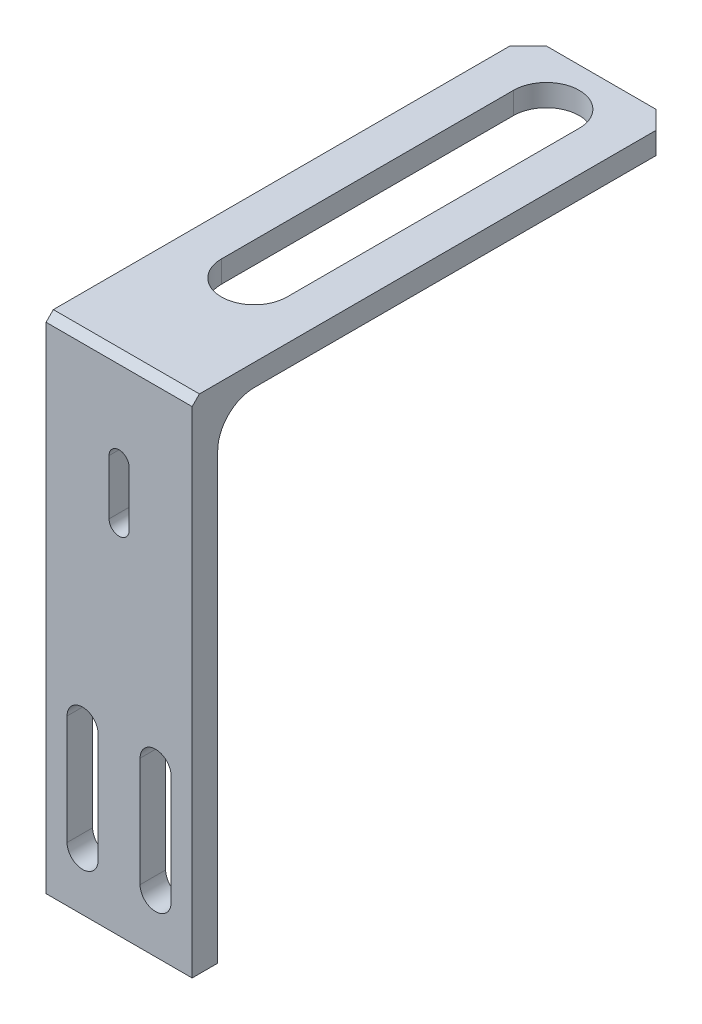
ISO-10303-21;
HEADER;
FILE_DESCRIPTION(('STEP AP214'),'2;1');
FILE_NAME('part.step','',(''),(''),'','','');
FILE_SCHEMA(('AUTOMOTIVE_DESIGN { 1 0 10303 214 1 1 1 1 }'));
ENDSEC;
DATA;
#1=APPLICATION_CONTEXT('core data for automotive mechanical design processes');
#2=APPLICATION_PROTOCOL_DEFINITION('international standard','automotive_design',2000,#1);
#3=PRODUCT_CONTEXT('',#1,'mechanical');
#4=PRODUCT('Part','Part','',(#3));
#5=PRODUCT_RELATED_PRODUCT_CATEGORY('part','',(#4));
#6=PRODUCT_DEFINITION_FORMATION('','',#4);
#7=PRODUCT_DEFINITION_CONTEXT('part definition',#1,'design');
#8=PRODUCT_DEFINITION('design','',#6,#7);
#9=PRODUCT_DEFINITION_SHAPE('','',#8);
#10=(LENGTH_UNIT() NAMED_UNIT(*) SI_UNIT(.MILLI.,.METRE.));
#11=(NAMED_UNIT(*) PLANE_ANGLE_UNIT() SI_UNIT($,.RADIAN.));
#12=(NAMED_UNIT(*) SI_UNIT($,.STERADIAN.) SOLID_ANGLE_UNIT());
#13=UNCERTAINTY_MEASURE_WITH_UNIT(LENGTH_MEASURE(1.E-05),#10,'distance_accuracy_value','');
#14=(GEOMETRIC_REPRESENTATION_CONTEXT(3) GLOBAL_UNCERTAINTY_ASSIGNED_CONTEXT((#13)) GLOBAL_UNIT_ASSIGNED_CONTEXT((#10,
#11,#12)) REPRESENTATION_CONTEXT('',''));
#15=CARTESIAN_POINT('',(0.,0.,0.));
#16=DIRECTION('',(0.,0.,1.));
#17=DIRECTION('',(1.,0.,0.));
#18=AXIS2_PLACEMENT_3D('',#15,#16,#17);
#19=CARTESIAN_POINT('',(0.,0.,0.));
#20=DIRECTION('',(0.,0.,-1.));
#21=DIRECTION('',(-1.,0.,0.));
#22=AXIS2_PLACEMENT_3D('',#19,#20,#21);
#23=PLANE('',#22);
#24=DIRECTION('',(2.93862156830471E-13,1.,0.));
#25=VECTOR('',#24,1.);
#26=CARTESIAN_POINT('',(-5.75000000000147,9.99999999999999,0.));
#27=LINE('',#26,#25);
#28=CARTESIAN_POINT('',(-5.75000000001029,-20.,0.));
#29=VERTEX_POINT('',#28);
#30=CARTESIAN_POINT('',(-5.75000000000147,9.99999999999999,0.));
#31=VERTEX_POINT('',#30);
#32=EDGE_CURVE('E327',#29,#31,#27,.T.);
#33=ORIENTED_EDGE('',*,*,#32,.T.);
#34=CARTESIAN_POINT('',(-9.99999999999951,9.99999999999999,0.));
#35=DIRECTION('',(0.,0.,1.));
#36=DIRECTION('',(1.,0.,0.));
#37=AXIS2_PLACEMENT_3D('',#34,#35,#36);
#38=CIRCLE('',#37,4.24999999999902);
#39=CARTESIAN_POINT('',(-14.2499999999995,9.99999999999999,0.));
#40=VERTEX_POINT('',#39);
#41=EDGE_CURVE('E323',#31,#40,#38,.T.);
#42=ORIENTED_EDGE('',*,*,#41,.T.);
#43=DIRECTION('',(0.,-1.,0.));
#44=VECTOR('',#43,1.);
#45=CARTESIAN_POINT('',(-14.2499999999995,9.99999999999999,0.));
#46=LINE('',#45,#44);
#47=CARTESIAN_POINT('',(-14.2499999999897,-20.,0.));
#48=VERTEX_POINT('',#47);
#49=EDGE_CURVE('E337',#40,#48,#46,.T.);
#50=ORIENTED_EDGE('',*,*,#49,.T.);
#51=CARTESIAN_POINT('',(-9.99999999999657,-20.,0.));
#52=DIRECTION('',(0.,0.,1.));
#53=DIRECTION('',(1.,0.,0.));
#54=AXIS2_PLACEMENT_3D('',#51,#52,#53);
#55=CIRCLE('',#54,4.24999999999315);
#56=EDGE_CURVE('E340',#48,#29,#55,.T.);
#57=ORIENTED_EDGE('',*,*,#56,.T.);
#58=EDGE_LOOP('',(#33,#42,#50,#57));
#59=FACE_BOUND('',#58,.T.);
#60=DIRECTION('',(0.,1.,0.));
#61=VECTOR('',#60,1.);
#62=CARTESIAN_POINT('',(14.2499999999995,9.99999999999999,0.));
#63=LINE('',#62,#61);
#64=CARTESIAN_POINT('',(14.2499999999897,-20.,0.));
#65=VERTEX_POINT('',#64);
#66=CARTESIAN_POINT('',(14.2499999999995,9.99999999999999,0.));
#67=VERTEX_POINT('',#66);
#68=EDGE_CURVE('E296',#65,#67,#63,.T.);
#69=ORIENTED_EDGE('',*,*,#68,.T.);
#70=CARTESIAN_POINT('',(9.99999999999951,9.99999999999999,0.));
#71=DIRECTION('',(0.,0.,1.));
#72=DIRECTION('',(-1.,0.,0.));
#73=AXIS2_PLACEMENT_3D('',#70,#71,#72);
#74=CIRCLE('',#73,4.24999999999902);
#75=CARTESIAN_POINT('',(5.75000000000147,9.99999999999999,0.));
#76=VERTEX_POINT('',#75);
#77=EDGE_CURVE('E292',#67,#76,#74,.T.);
#78=ORIENTED_EDGE('',*,*,#77,.T.);
#79=DIRECTION('',(2.93862156830471E-13,-1.,0.));
#80=VECTOR('',#79,1.);
#81=CARTESIAN_POINT('',(5.75000000000147,9.99999999999999,0.));
#82=LINE('',#81,#80);
#83=CARTESIAN_POINT('',(5.75000000001029,-20.,0.));
#84=VERTEX_POINT('',#83);
#85=EDGE_CURVE('E306',#76,#84,#82,.T.);
#86=ORIENTED_EDGE('',*,*,#85,.T.);
#87=CARTESIAN_POINT('',(9.99999999999657,-20.,0.));
#88=DIRECTION('',(0.,0.,1.));
#89=DIRECTION('',(-1.,0.,0.));
#90=AXIS2_PLACEMENT_3D('',#87,#88,#89);
#91=CIRCLE('',#90,4.24999999999315);
#92=EDGE_CURVE('E309',#84,#65,#91,.T.);
#93=ORIENTED_EDGE('',*,*,#92,.T.);
#94=EDGE_LOOP('',(#69,#78,#86,#93));
#95=FACE_BOUND('',#94,.T.);
#96=DIRECTION('',(0.,1.,0.));
#97=VECTOR('',#96,1.);
#98=CARTESIAN_POINT('',(2.75,77.5,0.));
#99=LINE('',#98,#97);
#100=CARTESIAN_POINT('',(2.75,62.5,0.));
#101=VERTEX_POINT('',#100);
#102=CARTESIAN_POINT('',(2.75,77.5,0.));
#103=VERTEX_POINT('',#102);
#104=EDGE_CURVE('E265',#101,#103,#99,.T.);
#105=ORIENTED_EDGE('',*,*,#104,.T.);
#106=CARTESIAN_POINT('',(0.,77.5,0.));
#107=DIRECTION('',(0.,0.,1.));
#108=DIRECTION('',(1.,0.,0.));
#109=AXIS2_PLACEMENT_3D('',#106,#107,#108);
#110=CIRCLE('',#109,2.75);
#111=CARTESIAN_POINT('',(-2.75,77.5,0.));
#112=VERTEX_POINT('',#111);
#113=EDGE_CURVE('E259',#103,#112,#110,.T.);
#114=ORIENTED_EDGE('',*,*,#113,.T.);
#115=DIRECTION('',(0.,-1.,0.));
#116=VECTOR('',#115,1.);
#117=CARTESIAN_POINT('',(-2.75,77.5,0.));
#118=LINE('',#117,#116);
#119=CARTESIAN_POINT('',(-2.75,62.5,0.));
#120=VERTEX_POINT('',#119);
#121=EDGE_CURVE('E275',#112,#120,#118,.T.);
#122=ORIENTED_EDGE('',*,*,#121,.T.);
#123=CARTESIAN_POINT('',(0.,62.5,0.));
#124=DIRECTION('',(0.,0.,1.));
#125=DIRECTION('',(1.,0.,0.));
#126=AXIS2_PLACEMENT_3D('',#123,#124,#125);
#127=CIRCLE('',#126,2.75);
#128=EDGE_CURVE('E278',#120,#101,#127,.T.);
#129=ORIENTED_EDGE('',*,*,#128,.T.);
#130=EDGE_LOOP('',(#105,#114,#122,#129));
#131=FACE_BOUND('',#130,.T.);
#132=DIRECTION('',(0.,-1.,0.));
#133=VECTOR('',#132,1.);
#134=CARTESIAN_POINT('',(-20.,-35.,0.));
#135=LINE('',#134,#133);
#136=CARTESIAN_POINT('',(-20.,86.5,0.));
#137=VERTEX_POINT('',#136);
#138=CARTESIAN_POINT('',(-20.,-35.,0.));
#139=VERTEX_POINT('',#138);
#140=EDGE_CURVE('E354',#137,#139,#135,.T.);
#141=ORIENTED_EDGE('',*,*,#140,.F.);
#142=DIRECTION('',(1.,0.,0.));
#143=VECTOR('',#142,1.);
#144=CARTESIAN_POINT('',(20.,86.5,0.));
#145=LINE('',#144,#143);
#146=CARTESIAN_POINT('',(20.,86.5,0.));
#147=VERTEX_POINT('',#146);
#148=EDGE_CURVE('E378',#137,#147,#145,.T.);
#149=ORIENTED_EDGE('',*,*,#148,.T.);
#150=DIRECTION('',(0.,1.,0.));
#151=VECTOR('',#150,1.);
#152=CARTESIAN_POINT('',(20.,-35.,0.));
#153=LINE('',#152,#151);
#154=CARTESIAN_POINT('',(20.,-35.,0.));
#155=VERTEX_POINT('',#154);
#156=EDGE_CURVE('E358',#155,#147,#153,.T.);
#157=ORIENTED_EDGE('',*,*,#156,.F.);
#158=DIRECTION('',(1.,0.,0.));
#159=VECTOR('',#158,1.);
#160=CARTESIAN_POINT('',(-20.,-35.,0.));
#161=LINE('',#160,#159);
#162=EDGE_CURVE('E365',#139,#155,#161,.T.);
#163=ORIENTED_EDGE('',*,*,#162,.F.);
#164=EDGE_LOOP('',(#141,#149,#157,#163));
#165=FACE_BOUND('',#164,.T.);
#166=ADVANCED_FACE('F35',(#59,#95,#131,#165),#23,.T.);
#167=CARTESIAN_POINT('',(0.,0.,7.));
#168=DIRECTION('',(0.,0.,-1.));
#169=DIRECTION('',(-1.,0.,0.));
#170=AXIS2_PLACEMENT_3D('',#167,#168,#169);
#171=PLANE('',#170);
#172=CARTESIAN_POINT('',(9.99999999999951,9.99999999999999,7.));
#173=DIRECTION('',(0.,0.,1.));
#174=DIRECTION('',(-1.,0.,0.));
#175=AXIS2_PLACEMENT_3D('',#172,#173,#174);
#176=CIRCLE('',#175,4.24999999999902);
#177=CARTESIAN_POINT('',(14.2499999999995,9.99999999999999,7.));
#178=VERTEX_POINT('',#177);
#179=CARTESIAN_POINT('',(5.75000000000147,9.99999999999999,7.));
#180=VERTEX_POINT('',#179);
#181=EDGE_CURVE('E293',#178,#180,#176,.T.);
#182=ORIENTED_EDGE('',*,*,#181,.F.);
#183=DIRECTION('',(0.,1.,0.));
#184=VECTOR('',#183,1.);
#185=CARTESIAN_POINT('',(14.2499999999995,9.99999999999999,7.));
#186=LINE('',#185,#184);
#187=CARTESIAN_POINT('',(14.2499999999966,-20.,7.));
#188=VERTEX_POINT('',#187);
#189=EDGE_CURVE('E301',#188,#178,#186,.T.);
#190=ORIENTED_EDGE('',*,*,#189,.F.);
#191=CARTESIAN_POINT('',(9.99999999999657,-20.,7.));
#192=DIRECTION('',(0.,0.,1.));
#193=DIRECTION('',(-1.,0.,0.));
#194=AXIS2_PLACEMENT_3D('',#191,#192,#193);
#195=CIRCLE('',#194,4.24999999999315);
#196=CARTESIAN_POINT('',(5.75000000001029,-20.,7.));
#197=VERTEX_POINT('',#196);
#198=EDGE_CURVE('E298',#197,#188,#195,.T.);
#199=ORIENTED_EDGE('',*,*,#198,.F.);
#200=DIRECTION('',(2.93862156830471E-13,-1.,0.));
#201=VECTOR('',#200,1.);
#202=CARTESIAN_POINT('',(5.75000000000147,9.99999999999999,7.));
#203=LINE('',#202,#201);
#204=EDGE_CURVE('E295',#180,#197,#203,.T.);
#205=ORIENTED_EDGE('',*,*,#204,.F.);
#206=EDGE_LOOP('',(#182,#190,#199,#205));
#207=FACE_BOUND('',#206,.T.);
#208=DIRECTION('',(0.,1.,0.));
#209=VECTOR('',#208,1.);
#210=CARTESIAN_POINT('',(20.,-35.,7.));
#211=LINE('',#210,#209);
#212=CARTESIAN_POINT('',(20.,-35.,7.));
#213=VERTEX_POINT('',#212);
#214=CARTESIAN_POINT('',(20.,100.5,7.));
#215=VERTEX_POINT('',#214);
#216=EDGE_CURVE('E360',#213,#215,#211,.T.);
#217=ORIENTED_EDGE('',*,*,#216,.T.);
#218=DIRECTION('',(-1.,0.,0.));
#219=VECTOR('',#218,1.);
#220=CARTESIAN_POINT('',(0.,100.5,7.));
#221=LINE('',#220,#219);
#222=CARTESIAN_POINT('',(-20.,100.5,7.));
#223=VERTEX_POINT('',#222);
#224=EDGE_CURVE('E407',#215,#223,#221,.T.);
#225=ORIENTED_EDGE('',*,*,#224,.T.);
#226=DIRECTION('',(0.,-1.,0.));
#227=VECTOR('',#226,1.);
#228=CARTESIAN_POINT('',(-20.,-35.,7.));
#229=LINE('',#228,#227);
#230=CARTESIAN_POINT('',(-20.,-35.,7.));
#231=VERTEX_POINT('',#230);
#232=EDGE_CURVE('E355',#223,#231,#229,.T.);
#233=ORIENTED_EDGE('',*,*,#232,.T.);
#234=DIRECTION('',(1.,0.,0.));
#235=VECTOR('',#234,1.);
#236=CARTESIAN_POINT('',(-20.,-35.,7.));
#237=LINE('',#236,#235);
#238=EDGE_CURVE('E357',#231,#213,#237,.T.);
#239=ORIENTED_EDGE('',*,*,#238,.T.);
#240=EDGE_LOOP('',(#217,#225,#233,#239));
#241=FACE_BOUND('',#240,.T.);
#242=CARTESIAN_POINT('',(-9.99999999999951,9.99999999999999,7.));
#243=DIRECTION('',(0.,0.,1.));
#244=DIRECTION('',(1.,0.,0.));
#245=AXIS2_PLACEMENT_3D('',#242,#243,#244);
#246=CIRCLE('',#245,4.24999999999902);
#247=CARTESIAN_POINT('',(-5.75000000000147,9.99999999999999,7.));
#248=VERTEX_POINT('',#247);
#249=CARTESIAN_POINT('',(-14.2499999999995,9.99999999999999,7.));
#250=VERTEX_POINT('',#249);
#251=EDGE_CURVE('E324',#248,#250,#246,.T.);
#252=ORIENTED_EDGE('',*,*,#251,.F.);
#253=DIRECTION('',(2.93862156830471E-13,1.,0.));
#254=VECTOR('',#253,1.);
#255=CARTESIAN_POINT('',(-5.75000000000147,9.99999999999999,7.));
#256=LINE('',#255,#254);
#257=CARTESIAN_POINT('',(-5.75000000001029,-20.,7.));
#258=VERTEX_POINT('',#257);
#259=EDGE_CURVE('E332',#258,#248,#256,.T.);
#260=ORIENTED_EDGE('',*,*,#259,.F.);
#261=CARTESIAN_POINT('',(-9.99999999999657,-20.,7.));
#262=DIRECTION('',(0.,0.,1.));
#263=DIRECTION('',(1.,0.,0.));
#264=AXIS2_PLACEMENT_3D('',#261,#262,#263);
#265=CIRCLE('',#264,4.24999999999315);
#266=CARTESIAN_POINT('',(-14.2499999999897,-20.,7.));
#267=VERTEX_POINT('',#266);
#268=EDGE_CURVE('E329',#267,#258,#265,.T.);
#269=ORIENTED_EDGE('',*,*,#268,.F.);
#270=DIRECTION('',(0.,-1.,0.));
#271=VECTOR('',#270,1.);
#272=CARTESIAN_POINT('',(-14.2499999999995,9.99999999999999,7.));
#273=LINE('',#272,#271);
#274=EDGE_CURVE('E326',#250,#267,#273,.T.);
#275=ORIENTED_EDGE('',*,*,#274,.F.);
#276=EDGE_LOOP('',(#252,#260,#269,#275));
#277=FACE_BOUND('',#276,.T.);
#278=CARTESIAN_POINT('',(0.,77.5,7.));
#279=DIRECTION('',(0.,0.,1.));
#280=DIRECTION('',(1.,0.,0.));
#281=AXIS2_PLACEMENT_3D('',#278,#279,#280);
#282=CIRCLE('',#281,2.75);
#283=CARTESIAN_POINT('',(2.75,77.5,7.));
#284=VERTEX_POINT('',#283);
#285=CARTESIAN_POINT('',(-2.75,77.5,7.));
#286=VERTEX_POINT('',#285);
#287=EDGE_CURVE('E262',#284,#286,#282,.T.);
#288=ORIENTED_EDGE('',*,*,#287,.F.);
#289=DIRECTION('',(0.,1.,0.));
#290=VECTOR('',#289,1.);
#291=CARTESIAN_POINT('',(2.75,77.5,7.));
#292=LINE('',#291,#290);
#293=CARTESIAN_POINT('',(2.75,62.5,7.));
#294=VERTEX_POINT('',#293);
#295=EDGE_CURVE('E270',#294,#284,#292,.T.);
#296=ORIENTED_EDGE('',*,*,#295,.F.);
#297=CARTESIAN_POINT('',(0.,62.5,7.));
#298=DIRECTION('',(0.,0.,1.));
#299=DIRECTION('',(1.,0.,0.));
#300=AXIS2_PLACEMENT_3D('',#297,#298,#299);
#301=CIRCLE('',#300,2.75);
#302=CARTESIAN_POINT('',(-2.75,62.5,7.));
#303=VERTEX_POINT('',#302);
#304=EDGE_CURVE('E267',#303,#294,#301,.T.);
#305=ORIENTED_EDGE('',*,*,#304,.F.);
#306=DIRECTION('',(0.,-1.,0.));
#307=VECTOR('',#306,1.);
#308=CARTESIAN_POINT('',(-2.75,77.5,7.));
#309=LINE('',#308,#307);
#310=EDGE_CURVE('E264',#286,#303,#309,.T.);
#311=ORIENTED_EDGE('',*,*,#310,.F.);
#312=EDGE_LOOP('',(#288,#296,#305,#311));
#313=FACE_BOUND('',#312,.T.);
#314=ADVANCED_FACE('F412',(#207,#241,#277,#313),#171,.F.);
#315=CARTESIAN_POINT('',(-20.,-35.,7.));
#316=DIRECTION('',(1.,0.,0.));
#317=DIRECTION('',(0.,0.,-1.));
#318=AXIS2_PLACEMENT_3D('',#315,#316,#317);
#319=PLANE('',#318);
#320=ORIENTED_EDGE('',*,*,#232,.F.);
#321=DIRECTION('',(0.,-0.707106781186543,0.707106781186552));
#322=VECTOR('',#321,1.);
#323=CARTESIAN_POINT('',(-20.,100.5,7.));
#324=LINE('',#323,#322);
#325=CARTESIAN_POINT('',(-20.,102.5,4.99999999999994));
#326=VERTEX_POINT('',#325);
#327=EDGE_CURVE('E58',#223,#326,#324,.F.);
#328=ORIENTED_EDGE('',*,*,#327,.T.);
#329=DIRECTION('',(0.,0.,-1.));
#330=VECTOR('',#329,1.);
#331=CARTESIAN_POINT('',(-20.,102.5,7.));
#332=LINE('',#331,#330);
#333=CARTESIAN_POINT('',(-20.,102.5,-120.));
#334=VERTEX_POINT('',#333);
#335=EDGE_CURVE('E363',#326,#334,#332,.T.);
#336=ORIENTED_EDGE('',*,*,#335,.T.);
#337=DIRECTION('',(0.,-1.,0.));
#338=VECTOR('',#337,1.);
#339=CARTESIAN_POINT('',(-20.,96.5,-120.));
#340=LINE('',#339,#338);
#341=CARTESIAN_POINT('',(-20.,96.5,-120.));
#342=VERTEX_POINT('',#341);
#343=EDGE_CURVE('E405',#334,#342,#340,.T.);
#344=ORIENTED_EDGE('',*,*,#343,.T.);
#345=DIRECTION('',(0.,0.,1.));
#346=VECTOR('',#345,1.);
#347=CARTESIAN_POINT('',(-20.,96.5,0.));
#348=LINE('',#347,#346);
#349=CARTESIAN_POINT('',(-20.,96.5,-10.));
#350=VERTEX_POINT('',#349);
#351=EDGE_CURVE('E257',#342,#350,#348,.T.);
#352=ORIENTED_EDGE('',*,*,#351,.T.);
#353=CARTESIAN_POINT('',(-20.,86.5,-10.));
#354=DIRECTION('',(1.,0.,0.));
#355=DIRECTION('',(0.,0.,-1.));
#356=AXIS2_PLACEMENT_3D('',#353,#354,#355);
#357=CIRCLE('',#356,10.);
#358=EDGE_CURVE('E386',#350,#137,#357,.T.);
#359=ORIENTED_EDGE('',*,*,#358,.T.);
#360=ORIENTED_EDGE('',*,*,#140,.T.);
#361=DIRECTION('',(0.,0.,-1.));
#362=VECTOR('',#361,1.);
#363=CARTESIAN_POINT('',(-20.,-35.,7.));
#364=LINE('',#363,#362);
#365=EDGE_CURVE('E375',#231,#139,#364,.T.);
#366=ORIENTED_EDGE('',*,*,#365,.F.);
#367=EDGE_LOOP('',(#320,#328,#336,#344,#352,#359,#360,#366));
#368=FACE_BOUND('',#367,.T.);
#369=ADVANCED_FACE('F419',(#368),#319,.F.);
#370=CARTESIAN_POINT('',(-20.,-35.,7.));
#371=DIRECTION('',(0.,1.,0.));
#372=DIRECTION('',(0.,0.,1.));
#373=AXIS2_PLACEMENT_3D('',#370,#371,#372);
#374=PLANE('',#373);
#375=ORIENTED_EDGE('',*,*,#162,.T.);
#376=DIRECTION('',(0.,0.,-1.));
#377=VECTOR('',#376,1.);
#378=CARTESIAN_POINT('',(20.,-35.,7.));
#379=LINE('',#378,#377);
#380=EDGE_CURVE('E372',#213,#155,#379,.T.);
#381=ORIENTED_EDGE('',*,*,#380,.F.);
#382=ORIENTED_EDGE('',*,*,#238,.F.);
#383=ORIENTED_EDGE('',*,*,#365,.T.);
#384=EDGE_LOOP('',(#375,#381,#382,#383));
#385=FACE_BOUND('',#384,.T.);
#386=ADVANCED_FACE('F423',(#385),#374,.F.);
#387=CARTESIAN_POINT('',(20.,-35.,7.));
#388=DIRECTION('',(-1.,0.,0.));
#389=DIRECTION('',(0.,0.,1.));
#390=AXIS2_PLACEMENT_3D('',#387,#388,#389);
#391=PLANE('',#390);
#392=DIRECTION('',(0.,0.,-1.));
#393=VECTOR('',#392,1.);
#394=CARTESIAN_POINT('',(20.,102.5,7.));
#395=LINE('',#394,#393);
#396=CARTESIAN_POINT('',(20.,102.5,4.99999999999994));
#397=VERTEX_POINT('',#396);
#398=CARTESIAN_POINT('',(20.,102.5,-120.));
#399=VERTEX_POINT('',#398);
#400=EDGE_CURVE('E370',#397,#399,#395,.T.);
#401=ORIENTED_EDGE('',*,*,#400,.F.);
#402=DIRECTION('',(0.,0.707106781186543,-0.707106781186552));
#403=VECTOR('',#402,1.);
#404=CARTESIAN_POINT('',(20.,100.5,7.));
#405=LINE('',#404,#403);
#406=EDGE_CURVE('E11',#397,#215,#405,.F.);
#407=ORIENTED_EDGE('',*,*,#406,.T.);
#408=ORIENTED_EDGE('',*,*,#216,.F.);
#409=ORIENTED_EDGE('',*,*,#380,.T.);
#410=ORIENTED_EDGE('',*,*,#156,.T.);
#411=CARTESIAN_POINT('',(20.,86.5,-10.));
#412=DIRECTION('',(-1.,0.,0.));
#413=DIRECTION('',(0.,0.,1.));
#414=AXIS2_PLACEMENT_3D('',#411,#412,#413);
#415=CIRCLE('',#414,10.);
#416=CARTESIAN_POINT('',(20.,96.5,-9.99999999999999));
#417=VERTEX_POINT('',#416);
#418=EDGE_CURVE('E384',#147,#417,#415,.T.);
#419=ORIENTED_EDGE('',*,*,#418,.T.);
#420=DIRECTION('',(0.,0.,-1.));
#421=VECTOR('',#420,1.);
#422=CARTESIAN_POINT('',(20.,96.5,-125.));
#423=LINE('',#422,#421);
#424=CARTESIAN_POINT('',(20.,96.5,-120.));
#425=VERTEX_POINT('',#424);
#426=EDGE_CURVE('E251',#417,#425,#423,.T.);
#427=ORIENTED_EDGE('',*,*,#426,.T.);
#428=DIRECTION('',(0.,1.,0.));
#429=VECTOR('',#428,1.);
#430=CARTESIAN_POINT('',(20.,102.5,-120.));
#431=LINE('',#430,#429);
#432=EDGE_CURVE('E388',#425,#399,#431,.T.);
#433=ORIENTED_EDGE('',*,*,#432,.T.);
#434=EDGE_LOOP('',(#401,#407,#408,#409,#410,#419,#427,#433));
#435=FACE_BOUND('',#434,.T.);
#436=ADVANCED_FACE('F427',(#435),#391,.F.);
#437=CARTESIAN_POINT('',(-20.,102.5,7.));
#438=DIRECTION('',(0.,-1.,0.));
#439=DIRECTION('',(0.,0.,-1.));
#440=AXIS2_PLACEMENT_3D('',#437,#438,#439);
#441=PLANE('',#440);
#442=ORIENTED_EDGE('',*,*,#335,.F.);
#443=DIRECTION('',(1.,0.,0.));
#444=VECTOR('',#443,1.);
#445=CARTESIAN_POINT('',(-20.,102.5,4.99999999999994));
#446=LINE('',#445,#444);
#447=EDGE_CURVE('E44',#326,#397,#446,.T.);
#448=ORIENTED_EDGE('',*,*,#447,.T.);
#449=ORIENTED_EDGE('',*,*,#400,.T.);
#450=DIRECTION('',(-0.707106781186549,0.,-0.707106781186546));
#451=VECTOR('',#450,1.);
#452=CARTESIAN_POINT('',(20.,102.5,-120.));
#453=LINE('',#452,#451);
#454=CARTESIAN_POINT('',(15.,102.5,-125.));
#455=VERTEX_POINT('',#454);
#456=EDGE_CURVE('E394',#399,#455,#453,.T.);
#457=ORIENTED_EDGE('',*,*,#456,.T.);
#458=DIRECTION('',(-1.,0.,0.));
#459=VECTOR('',#458,1.);
#460=CARTESIAN_POINT('',(-20.,102.5,-125.));
#461=LINE('',#460,#459);
#462=CARTESIAN_POINT('',(-15.,102.5,-125.));
#463=VERTEX_POINT('',#462);
#464=EDGE_CURVE('E247',#455,#463,#461,.T.);
#465=ORIENTED_EDGE('',*,*,#464,.T.);
#466=DIRECTION('',(-0.707106781186546,0.,0.707106781186549));
#467=VECTOR('',#466,1.);
#468=CARTESIAN_POINT('',(-15.,102.5,-125.));
#469=LINE('',#468,#467);
#470=EDGE_CURVE('E391',#463,#334,#469,.T.);
#471=ORIENTED_EDGE('',*,*,#470,.T.);
#472=EDGE_LOOP('',(#442,#448,#449,#457,#465,#471));
#473=FACE_BOUND('',#472,.T.);
#474=DIRECTION('',(0.,0.,-1.));
#475=VECTOR('',#474,1.);
#476=CARTESIAN_POINT('',(9.,102.5,-30.));
#477=LINE('',#476,#475);
#478=CARTESIAN_POINT('',(9.,102.5,-30.));
#479=VERTEX_POINT('',#478);
#480=CARTESIAN_POINT('',(9.,102.5,-110.));
#481=VERTEX_POINT('',#480);
#482=EDGE_CURVE('E241',#479,#481,#477,.T.);
#483=ORIENTED_EDGE('',*,*,#482,.F.);
#484=CARTESIAN_POINT('',(0.,102.5,-30.));
#485=DIRECTION('',(0.,1.,0.));
#486=DIRECTION('',(0.,0.,1.));
#487=AXIS2_PLACEMENT_3D('',#484,#485,#486);
#488=CIRCLE('',#487,9.);
#489=CARTESIAN_POINT('',(-9.,102.5,-30.));
#490=VERTEX_POINT('',#489);
#491=EDGE_CURVE('E214',#490,#479,#488,.T.);
#492=ORIENTED_EDGE('',*,*,#491,.F.);
#493=DIRECTION('',(0.,0.,1.));
#494=VECTOR('',#493,1.);
#495=CARTESIAN_POINT('',(-9.,102.5,-30.));
#496=LINE('',#495,#494);
#497=CARTESIAN_POINT('',(-9.,102.5,-110.));
#498=VERTEX_POINT('',#497);
#499=EDGE_CURVE('E232',#498,#490,#496,.T.);
#500=ORIENTED_EDGE('',*,*,#499,.F.);
#501=CARTESIAN_POINT('',(0.,102.5,-110.));
#502=DIRECTION('',(0.,1.,0.));
#503=DIRECTION('',(0.,0.,1.));
#504=AXIS2_PLACEMENT_3D('',#501,#502,#503);
#505=CIRCLE('',#504,9.);
#506=EDGE_CURVE('E235',#481,#498,#505,.T.);
#507=ORIENTED_EDGE('',*,*,#506,.F.);
#508=EDGE_LOOP('',(#483,#492,#500,#507));
#509=FACE_BOUND('',#508,.T.);
#510=ADVANCED_FACE('F446',(#473,#509),#441,.F.);
#511=CARTESIAN_POINT('',(-9.99999999999951,9.99999999999999,7.));
#512=DIRECTION('',(0.,0.,-1.));
#513=DIRECTION('',(-1.,0.,0.));
#514=AXIS2_PLACEMENT_3D('',#511,#512,#513);
#515=CYLINDRICAL_SURFACE('',#514,4.24999999999902);
#516=ORIENTED_EDGE('',*,*,#41,.F.);
#517=DIRECTION('',(0.,0.,-1.));
#518=VECTOR('',#517,1.);
#519=CARTESIAN_POINT('',(-5.75000000000147,9.99999999999999,7.));
#520=LINE('',#519,#518);
#521=EDGE_CURVE('E334',#248,#31,#520,.T.);
#522=ORIENTED_EDGE('',*,*,#521,.F.);
#523=ORIENTED_EDGE('',*,*,#251,.T.);
#524=DIRECTION('',(0.,0.,-1.));
#525=VECTOR('',#524,1.);
#526=CARTESIAN_POINT('',(-14.2499999999995,9.99999999999999,7.));
#527=LINE('',#526,#525);
#528=EDGE_CURVE('E351',#250,#40,#527,.T.);
#529=ORIENTED_EDGE('',*,*,#528,.T.);
#530=EDGE_LOOP('',(#516,#522,#523,#529));
#531=FACE_BOUND('',#530,.T.);
#532=ADVANCED_FACE('F449',(#531),#515,.F.);
#533=CARTESIAN_POINT('',(-14.2499999999995,9.99999999999999,7.));
#534=DIRECTION('',(1.,0.,0.));
#535=DIRECTION('',(0.,1.,0.));
#536=AXIS2_PLACEMENT_3D('',#533,#534,#535);
#537=PLANE('',#536);
#538=ORIENTED_EDGE('',*,*,#49,.F.);
#539=ORIENTED_EDGE('',*,*,#528,.F.);
#540=ORIENTED_EDGE('',*,*,#274,.T.);
#541=DIRECTION('',(0.,0.,-1.));
#542=VECTOR('',#541,1.);
#543=CARTESIAN_POINT('',(-14.2499999999897,-20.,7.));
#544=LINE('',#543,#542);
#545=EDGE_CURVE('E349',#267,#48,#544,.T.);
#546=ORIENTED_EDGE('',*,*,#545,.T.);
#547=EDGE_LOOP('',(#538,#539,#540,#546));
#548=FACE_BOUND('',#547,.T.);
#549=ADVANCED_FACE('F550',(#548),#537,.T.);
#550=CARTESIAN_POINT('',(-9.99999999999657,-20.,7.));
#551=DIRECTION('',(0.,0.,-1.));
#552=DIRECTION('',(-1.,0.,0.));
#553=AXIS2_PLACEMENT_3D('',#550,#551,#552);
#554=CYLINDRICAL_SURFACE('',#553,4.24999999999315);
#555=ORIENTED_EDGE('',*,*,#56,.F.);
#556=ORIENTED_EDGE('',*,*,#545,.F.);
#557=ORIENTED_EDGE('',*,*,#268,.T.);
#558=DIRECTION('',(0.,0.,-1.));
#559=VECTOR('',#558,1.);
#560=CARTESIAN_POINT('',(-5.75000000001029,-20.,7.));
#561=LINE('',#560,#559);
#562=EDGE_CURVE('E347',#258,#29,#561,.T.);
#563=ORIENTED_EDGE('',*,*,#562,.T.);
#564=EDGE_LOOP('',(#555,#556,#557,#563));
#565=FACE_BOUND('',#564,.T.);
#566=ADVANCED_FACE('F546',(#565),#554,.F.);
#567=CARTESIAN_POINT('',(-5.75000000000147,9.99999999999999,7.));
#568=DIRECTION('',(-1.,2.93862156830471E-13,0.));
#569=DIRECTION('',(-2.93862156830471E-13,-1.,0.));
#570=AXIS2_PLACEMENT_3D('',#567,#568,#569);
#571=PLANE('',#570);
#572=ORIENTED_EDGE('',*,*,#32,.F.);
#573=ORIENTED_EDGE('',*,*,#562,.F.);
#574=ORIENTED_EDGE('',*,*,#259,.T.);
#575=ORIENTED_EDGE('',*,*,#521,.T.);
#576=EDGE_LOOP('',(#572,#573,#574,#575));
#577=FACE_BOUND('',#576,.T.);
#578=ADVANCED_FACE('F542',(#577),#571,.T.);
#579=CARTESIAN_POINT('',(9.99999999999951,9.99999999999999,7.));
#580=DIRECTION('',(0.,0.,-1.));
#581=DIRECTION('',(-1.,0.,0.));
#582=AXIS2_PLACEMENT_3D('',#579,#580,#581);
#583=CYLINDRICAL_SURFACE('',#582,4.24999999999902);
#584=ORIENTED_EDGE('',*,*,#77,.F.);
#585=DIRECTION('',(0.,0.,-1.));
#586=VECTOR('',#585,1.);
#587=CARTESIAN_POINT('',(14.2499999999995,9.99999999999999,7.));
#588=LINE('',#587,#586);
#589=EDGE_CURVE('E303',#178,#67,#588,.T.);
#590=ORIENTED_EDGE('',*,*,#589,.F.);
#591=ORIENTED_EDGE('',*,*,#181,.T.);
#592=DIRECTION('',(0.,0.,-1.));
#593=VECTOR('',#592,1.);
#594=CARTESIAN_POINT('',(5.75000000000147,9.99999999999999,7.));
#595=LINE('',#594,#593);
#596=EDGE_CURVE('E320',#180,#76,#595,.T.);
#597=ORIENTED_EDGE('',*,*,#596,.T.);
#598=EDGE_LOOP('',(#584,#590,#591,#597));
#599=FACE_BOUND('',#598,.T.);
#600=ADVANCED_FACE('F538',(#599),#583,.F.);
#601=CARTESIAN_POINT('',(5.75000000000147,9.99999999999999,7.));
#602=DIRECTION('',(1.,2.93862156830471E-13,0.));
#603=DIRECTION('',(-2.93862156830471E-13,1.,0.));
#604=AXIS2_PLACEMENT_3D('',#601,#602,#603);
#605=PLANE('',#604);
#606=ORIENTED_EDGE('',*,*,#85,.F.);
#607=ORIENTED_EDGE('',*,*,#596,.F.);
#608=ORIENTED_EDGE('',*,*,#204,.T.);
#609=DIRECTION('',(0.,0.,-1.));
#610=VECTOR('',#609,1.);
#611=CARTESIAN_POINT('',(5.75000000001029,-20.,7.));
#612=LINE('',#611,#610);
#613=EDGE_CURVE('E318',#197,#84,#612,.T.);
#614=ORIENTED_EDGE('',*,*,#613,.T.);
#615=EDGE_LOOP('',(#606,#607,#608,#614));
#616=FACE_BOUND('',#615,.T.);
#617=ADVANCED_FACE('F534',(#616),#605,.T.);
#618=CARTESIAN_POINT('',(9.99999999999657,-20.,7.));
#619=DIRECTION('',(0.,0.,-1.));
#620=DIRECTION('',(-1.,0.,0.));
#621=AXIS2_PLACEMENT_3D('',#618,#619,#620);
#622=CYLINDRICAL_SURFACE('',#621,4.24999999999315);
#623=ORIENTED_EDGE('',*,*,#92,.F.);
#624=ORIENTED_EDGE('',*,*,#613,.F.);
#625=ORIENTED_EDGE('',*,*,#198,.T.);
#626=DIRECTION('',(0.,0.,-1.));
#627=VECTOR('',#626,1.);
#628=CARTESIAN_POINT('',(14.2499999999897,-20.,7.));
#629=LINE('',#628,#627);
#630=EDGE_CURVE('E316',#188,#65,#629,.T.);
#631=ORIENTED_EDGE('',*,*,#630,.T.);
#632=EDGE_LOOP('',(#623,#624,#625,#631));
#633=FACE_BOUND('',#632,.T.);
#634=ADVANCED_FACE('F530',(#633),#622,.F.);
#635=CARTESIAN_POINT('',(14.2499999999995,9.99999999999999,7.));
#636=DIRECTION('',(-1.,0.,0.));
#637=DIRECTION('',(0.,-1.,0.));
#638=AXIS2_PLACEMENT_3D('',#635,#636,#637);
#639=PLANE('',#638);
#640=ORIENTED_EDGE('',*,*,#68,.F.);
#641=ORIENTED_EDGE('',*,*,#630,.F.);
#642=ORIENTED_EDGE('',*,*,#189,.T.);
#643=ORIENTED_EDGE('',*,*,#589,.T.);
#644=EDGE_LOOP('',(#640,#641,#642,#643));
#645=FACE_BOUND('',#644,.T.);
#646=ADVANCED_FACE('F526',(#645),#639,.T.);
#647=CARTESIAN_POINT('',(0.,77.5,7.));
#648=DIRECTION('',(0.,0.,-1.));
#649=DIRECTION('',(-1.,0.,0.));
#650=AXIS2_PLACEMENT_3D('',#647,#648,#649);
#651=CYLINDRICAL_SURFACE('',#650,2.75);
#652=ORIENTED_EDGE('',*,*,#113,.F.);
#653=DIRECTION('',(0.,0.,-1.));
#654=VECTOR('',#653,1.);
#655=CARTESIAN_POINT('',(2.75,77.5,7.));
#656=LINE('',#655,#654);
#657=EDGE_CURVE('E272',#284,#103,#656,.T.);
#658=ORIENTED_EDGE('',*,*,#657,.F.);
#659=ORIENTED_EDGE('',*,*,#287,.T.);
#660=DIRECTION('',(0.,0.,-1.));
#661=VECTOR('',#660,1.);
#662=CARTESIAN_POINT('',(-2.75,77.5,7.));
#663=LINE('',#662,#661);
#664=EDGE_CURVE('E289',#286,#112,#663,.T.);
#665=ORIENTED_EDGE('',*,*,#664,.T.);
#666=EDGE_LOOP('',(#652,#658,#659,#665));
#667=FACE_BOUND('',#666,.T.);
#668=ADVANCED_FACE('F522',(#667),#651,.F.);
#669=CARTESIAN_POINT('',(-2.75,77.5,7.));
#670=DIRECTION('',(1.,0.,0.));
#671=DIRECTION('',(0.,1.,0.));
#672=AXIS2_PLACEMENT_3D('',#669,#670,#671);
#673=PLANE('',#672);
#674=ORIENTED_EDGE('',*,*,#121,.F.);
#675=ORIENTED_EDGE('',*,*,#664,.F.);
#676=ORIENTED_EDGE('',*,*,#310,.T.);
#677=DIRECTION('',(0.,0.,-1.));
#678=VECTOR('',#677,1.);
#679=CARTESIAN_POINT('',(-2.75,62.5,7.));
#680=LINE('',#679,#678);
#681=EDGE_CURVE('E287',#303,#120,#680,.T.);
#682=ORIENTED_EDGE('',*,*,#681,.T.);
#683=EDGE_LOOP('',(#674,#675,#676,#682));
#684=FACE_BOUND('',#683,.T.);
#685=ADVANCED_FACE('F518',(#684),#673,.T.);
#686=CARTESIAN_POINT('',(0.,62.5,7.));
#687=DIRECTION('',(0.,0.,-1.));
#688=DIRECTION('',(-1.,0.,0.));
#689=AXIS2_PLACEMENT_3D('',#686,#687,#688);
#690=CYLINDRICAL_SURFACE('',#689,2.75);
#691=ORIENTED_EDGE('',*,*,#128,.F.);
#692=ORIENTED_EDGE('',*,*,#681,.F.);
#693=ORIENTED_EDGE('',*,*,#304,.T.);
#694=DIRECTION('',(0.,0.,-1.));
#695=VECTOR('',#694,1.);
#696=CARTESIAN_POINT('',(2.75,62.5,7.));
#697=LINE('',#696,#695);
#698=EDGE_CURVE('E285',#294,#101,#697,.T.);
#699=ORIENTED_EDGE('',*,*,#698,.T.);
#700=EDGE_LOOP('',(#691,#692,#693,#699));
#701=FACE_BOUND('',#700,.T.);
#702=ADVANCED_FACE('F514',(#701),#690,.F.);
#703=CARTESIAN_POINT('',(2.75,77.5,7.));
#704=DIRECTION('',(-1.,0.,0.));
#705=DIRECTION('',(0.,-1.,0.));
#706=AXIS2_PLACEMENT_3D('',#703,#704,#705);
#707=PLANE('',#706);
#708=ORIENTED_EDGE('',*,*,#104,.F.);
#709=ORIENTED_EDGE('',*,*,#698,.F.);
#710=ORIENTED_EDGE('',*,*,#295,.T.);
#711=ORIENTED_EDGE('',*,*,#657,.T.);
#712=EDGE_LOOP('',(#708,#709,#710,#711));
#713=FACE_BOUND('',#712,.T.);
#714=ADVANCED_FACE('F511',(#713),#707,.T.);
#715=CARTESIAN_POINT('',(-20.,96.5,-125.));
#716=DIRECTION('',(0.,0.,-1.));
#717=DIRECTION('',(-1.,0.,0.));
#718=AXIS2_PLACEMENT_3D('',#715,#716,#717);
#719=PLANE('',#718);
#720=ORIENTED_EDGE('',*,*,#464,.F.);
#721=DIRECTION('',(0.,-1.,0.));
#722=VECTOR('',#721,1.);
#723=CARTESIAN_POINT('',(15.,96.5,-125.));
#724=LINE('',#723,#722);
#725=CARTESIAN_POINT('',(15.,96.5,-125.));
#726=VERTEX_POINT('',#725);
#727=EDGE_CURVE('E399',#455,#726,#724,.T.);
#728=ORIENTED_EDGE('',*,*,#727,.T.);
#729=DIRECTION('',(-1.,0.,0.));
#730=VECTOR('',#729,1.);
#731=CARTESIAN_POINT('',(-20.,96.5,-125.));
#732=LINE('',#731,#730);
#733=CARTESIAN_POINT('',(-15.,96.5,-125.));
#734=VERTEX_POINT('',#733);
#735=EDGE_CURVE('E254',#726,#734,#732,.T.);
#736=ORIENTED_EDGE('',*,*,#735,.T.);
#737=DIRECTION('',(0.,1.,0.));
#738=VECTOR('',#737,1.);
#739=CARTESIAN_POINT('',(-15.,102.5,-125.));
#740=LINE('',#739,#738);
#741=EDGE_CURVE('E396',#734,#463,#740,.T.);
#742=ORIENTED_EDGE('',*,*,#741,.T.);
#743=EDGE_LOOP('',(#720,#728,#736,#742));
#744=FACE_BOUND('',#743,.T.);
#745=ADVANCED_FACE('F488',(#744),#719,.T.);
#746=CARTESIAN_POINT('',(0.,96.5,0.));
#747=DIRECTION('',(0.,-1.,0.));
#748=DIRECTION('',(0.,0.,-1.));
#749=AXIS2_PLACEMENT_3D('',#746,#747,#748);
#750=PLANE('',#749);
#751=CARTESIAN_POINT('',(0.,96.5,-30.));
#752=DIRECTION('',(0.,1.,0.));
#753=DIRECTION('',(0.,0.,1.));
#754=AXIS2_PLACEMENT_3D('',#751,#752,#753);
#755=CIRCLE('',#754,9.);
#756=CARTESIAN_POINT('',(-9.,96.5,-30.));
#757=VERTEX_POINT('',#756);
#758=CARTESIAN_POINT('',(9.,96.5,-30.));
#759=VERTEX_POINT('',#758);
#760=EDGE_CURVE('E211',#757,#759,#755,.T.);
#761=ORIENTED_EDGE('',*,*,#760,.T.);
#762=DIRECTION('',(0.,0.,-1.));
#763=VECTOR('',#762,1.);
#764=CARTESIAN_POINT('',(9.,96.5,-30.));
#765=LINE('',#764,#763);
#766=CARTESIAN_POINT('',(9.,96.5,-110.));
#767=VERTEX_POINT('',#766);
#768=EDGE_CURVE('E223',#759,#767,#765,.T.);
#769=ORIENTED_EDGE('',*,*,#768,.T.);
#770=CARTESIAN_POINT('',(0.,96.5,-110.));
#771=DIRECTION('',(0.,1.,0.));
#772=DIRECTION('',(0.,0.,1.));
#773=AXIS2_PLACEMENT_3D('',#770,#771,#772);
#774=CIRCLE('',#773,9.);
#775=CARTESIAN_POINT('',(-9.,96.5,-110.));
#776=VERTEX_POINT('',#775);
#777=EDGE_CURVE('E227',#767,#776,#774,.T.);
#778=ORIENTED_EDGE('',*,*,#777,.T.);
#779=DIRECTION('',(0.,0.,1.));
#780=VECTOR('',#779,1.);
#781=CARTESIAN_POINT('',(-9.,96.5,-30.));
#782=LINE('',#781,#780);
#783=EDGE_CURVE('E219',#776,#757,#782,.T.);
#784=ORIENTED_EDGE('',*,*,#783,.T.);
#785=EDGE_LOOP('',(#761,#769,#778,#784));
#786=FACE_BOUND('',#785,.T.);
#787=ORIENTED_EDGE('',*,*,#735,.F.);
#788=DIRECTION('',(0.707106781186549,0.,0.707106781186546));
#789=VECTOR('',#788,1.);
#790=CARTESIAN_POINT('',(69.9999999999999,96.5,-70.0000000000003));
#791=LINE('',#790,#789);
#792=EDGE_CURVE('E403',#726,#425,#791,.T.);
#793=ORIENTED_EDGE('',*,*,#792,.T.);
#794=ORIENTED_EDGE('',*,*,#426,.F.);
#795=DIRECTION('',(1.,0.,0.));
#796=VECTOR('',#795,1.);
#797=CARTESIAN_POINT('',(-20.,96.5,-10.));
#798=LINE('',#797,#796);
#799=EDGE_CURVE('E381',#417,#350,#798,.F.);
#800=ORIENTED_EDGE('',*,*,#799,.T.);
#801=ORIENTED_EDGE('',*,*,#351,.F.);
#802=DIRECTION('',(0.707106781186546,0.,-0.707106781186549));
#803=VECTOR('',#802,1.);
#804=CARTESIAN_POINT('',(-70.,96.5,-69.9999999999997));
#805=LINE('',#804,#803);
#806=EDGE_CURVE('E401',#342,#734,#805,.T.);
#807=ORIENTED_EDGE('',*,*,#806,.T.);
#808=EDGE_LOOP('',(#787,#793,#794,#800,#801,#807));
#809=FACE_BOUND('',#808,.T.);
#810=ADVANCED_FACE('F229',(#786,#809),#750,.T.);
#811=CARTESIAN_POINT('',(0.,96.5,-30.));
#812=DIRECTION('',(0.,1.,0.));
#813=DIRECTION('',(0.,0.,1.));
#814=AXIS2_PLACEMENT_3D('',#811,#812,#813);
#815=CYLINDRICAL_SURFACE('',#814,9.);
#816=ORIENTED_EDGE('',*,*,#491,.T.);
#817=DIRECTION('',(0.,1.,0.));
#818=VECTOR('',#817,1.);
#819=CARTESIAN_POINT('',(9.,96.5,-30.));
#820=LINE('',#819,#818);
#821=EDGE_CURVE('E207',#759,#479,#820,.T.);
#822=ORIENTED_EDGE('',*,*,#821,.F.);
#823=ORIENTED_EDGE('',*,*,#760,.F.);
#824=DIRECTION('',(0.,1.,0.));
#825=VECTOR('',#824,1.);
#826=CARTESIAN_POINT('',(-9.,96.5,-30.));
#827=LINE('',#826,#825);
#828=EDGE_CURVE('E245',#757,#490,#827,.T.);
#829=ORIENTED_EDGE('',*,*,#828,.T.);
#830=EDGE_LOOP('',(#816,#822,#823,#829));
#831=FACE_BOUND('',#830,.T.);
#832=ADVANCED_FACE('F209',(#831),#815,.F.);
#833=CARTESIAN_POINT('',(-9.,96.5,-30.));
#834=DIRECTION('',(-1.,0.,0.));
#835=DIRECTION('',(0.,0.,1.));
#836=AXIS2_PLACEMENT_3D('',#833,#834,#835);
#837=PLANE('',#836);
#838=ORIENTED_EDGE('',*,*,#499,.T.);
#839=ORIENTED_EDGE('',*,*,#828,.F.);
#840=ORIENTED_EDGE('',*,*,#783,.F.);
#841=DIRECTION('',(0.,1.,0.));
#842=VECTOR('',#841,1.);
#843=CARTESIAN_POINT('',(-9.,96.5,-110.));
#844=LINE('',#843,#842);
#845=EDGE_CURVE('E248',#776,#498,#844,.T.);
#846=ORIENTED_EDGE('',*,*,#845,.T.);
#847=EDGE_LOOP('',(#838,#839,#840,#846));
#848=FACE_BOUND('',#847,.T.);
#849=ADVANCED_FACE('F495',(#848),#837,.F.);
#850=CARTESIAN_POINT('',(0.,96.5,-110.));
#851=DIRECTION('',(0.,1.,0.));
#852=DIRECTION('',(0.,0.,1.));
#853=AXIS2_PLACEMENT_3D('',#850,#851,#852);
#854=CYLINDRICAL_SURFACE('',#853,9.);
#855=ORIENTED_EDGE('',*,*,#506,.T.);
#856=ORIENTED_EDGE('',*,*,#845,.F.);
#857=ORIENTED_EDGE('',*,*,#777,.F.);
#858=DIRECTION('',(0.,1.,0.));
#859=VECTOR('',#858,1.);
#860=CARTESIAN_POINT('',(9.,96.5,-110.));
#861=LINE('',#860,#859);
#862=EDGE_CURVE('E218',#767,#481,#861,.T.);
#863=ORIENTED_EDGE('',*,*,#862,.T.);
#864=EDGE_LOOP('',(#855,#856,#857,#863));
#865=FACE_BOUND('',#864,.T.);
#866=ADVANCED_FACE('F493',(#865),#854,.F.);
#867=CARTESIAN_POINT('',(9.,96.5,-30.));
#868=DIRECTION('',(1.,0.,0.));
#869=DIRECTION('',(0.,0.,-1.));
#870=AXIS2_PLACEMENT_3D('',#867,#868,#869);
#871=PLANE('',#870);
#872=ORIENTED_EDGE('',*,*,#482,.T.);
#873=ORIENTED_EDGE('',*,*,#862,.F.);
#874=ORIENTED_EDGE('',*,*,#768,.F.);
#875=ORIENTED_EDGE('',*,*,#821,.T.);
#876=EDGE_LOOP('',(#872,#873,#874,#875));
#877=FACE_BOUND('',#876,.T.);
#878=ADVANCED_FACE('F224',(#877),#871,.F.);
#879=CARTESIAN_POINT('',(0.,86.5,-10.));
#880=DIRECTION('',(-1.,0.,0.));
#881=DIRECTION('',(0.,0.,1.));
#882=AXIS2_PLACEMENT_3D('',#879,#880,#881);
#883=CYLINDRICAL_SURFACE('',#882,10.);
#884=ORIENTED_EDGE('',*,*,#358,.F.);
#885=ORIENTED_EDGE('',*,*,#799,.F.);
#886=ORIENTED_EDGE('',*,*,#418,.F.);
#887=ORIENTED_EDGE('',*,*,#148,.F.);
#888=EDGE_LOOP('',(#884,#885,#886,#887));
#889=FACE_BOUND('',#888,.T.);
#890=ADVANCED_FACE('F456',(#889),#883,.F.);
#891=CARTESIAN_POINT('',(20.,-35.,-120.));
#892=DIRECTION('',(0.707106781186546,0.,-0.707106781186549));
#893=DIRECTION('',(0.,-1.,0.));
#894=AXIS2_PLACEMENT_3D('',#891,#892,#893);
#895=PLANE('',#894);
#896=ORIENTED_EDGE('',*,*,#792,.F.);
#897=ORIENTED_EDGE('',*,*,#727,.F.);
#898=ORIENTED_EDGE('',*,*,#456,.F.);
#899=ORIENTED_EDGE('',*,*,#432,.F.);
#900=EDGE_LOOP('',(#896,#897,#898,#899));
#901=FACE_BOUND('',#900,.T.);
#902=ADVANCED_FACE('F433',(#901),#895,.T.);
#903=CARTESIAN_POINT('',(-15.,96.5,-125.));
#904=DIRECTION('',(-0.707106781186549,0.,-0.707106781186546));
#905=DIRECTION('',(0.,-1.,0.));
#906=AXIS2_PLACEMENT_3D('',#903,#904,#905);
#907=PLANE('',#906);
#908=ORIENTED_EDGE('',*,*,#806,.F.);
#909=ORIENTED_EDGE('',*,*,#343,.F.);
#910=ORIENTED_EDGE('',*,*,#470,.F.);
#911=ORIENTED_EDGE('',*,*,#741,.F.);
#912=EDGE_LOOP('',(#908,#909,#910,#911));
#913=FACE_BOUND('',#912,.T.);
#914=ADVANCED_FACE('F429',(#913),#907,.T.);
#915=CARTESIAN_POINT('',(0.,100.5,7.));
#916=DIRECTION('',(0.,-0.707106781186552,-0.707106781186543));
#917=DIRECTION('',(-1.,0.,0.));
#918=AXIS2_PLACEMENT_3D('',#915,#916,#917);
#919=PLANE('',#918);
#920=ORIENTED_EDGE('',*,*,#406,.F.);
#921=ORIENTED_EDGE('',*,*,#447,.F.);
#922=ORIENTED_EDGE('',*,*,#327,.F.);
#923=ORIENTED_EDGE('',*,*,#224,.F.);
#924=EDGE_LOOP('',(#920,#921,#922,#923));
#925=FACE_BOUND('',#924,.T.);
#926=ADVANCED_FACE('F38',(#925),#919,.F.);
#927=CLOSED_SHELL('',(#166,#314,#369,#386,#436,#510,#532,#549,#566,#578,#600,#617,#634,#646,
#668,#685,#702,#714,#745,#810,#832,#849,#866,#878,#890,#902,#914,#926));
#928=MANIFOLD_SOLID_BREP('B2',#927);
#929=ADVANCED_BREP_SHAPE_REPRESENTATION('',(#18,#928),#14);
#930=SHAPE_DEFINITION_REPRESENTATION(#9,#929);
ENDSEC;
END-ISO-10303-21;
